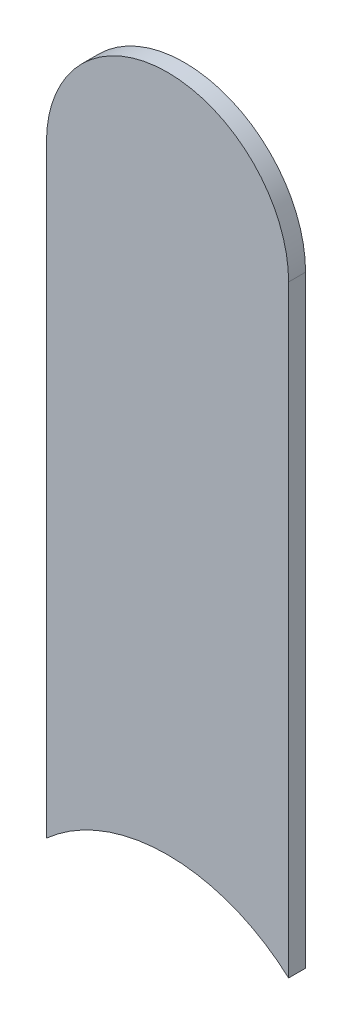
ISO-10303-21;
HEADER;
FILE_DESCRIPTION(('STEP AP214'),'2;1');
FILE_NAME('part.step','',(''),(''),'','','');
FILE_SCHEMA(('AUTOMOTIVE_DESIGN { 1 0 10303 214 1 1 1 1 }'));
ENDSEC;
DATA;
#1=APPLICATION_CONTEXT('core data for automotive mechanical design processes');
#2=APPLICATION_PROTOCOL_DEFINITION('international standard','automotive_design',2000,#1);
#3=PRODUCT_CONTEXT('',#1,'mechanical');
#4=PRODUCT('Part','Part','',(#3));
#5=PRODUCT_RELATED_PRODUCT_CATEGORY('part','',(#4));
#6=PRODUCT_DEFINITION_FORMATION('','',#4);
#7=PRODUCT_DEFINITION_CONTEXT('part definition',#1,'design');
#8=PRODUCT_DEFINITION('design','',#6,#7);
#9=PRODUCT_DEFINITION_SHAPE('','',#8);
#10=(LENGTH_UNIT() NAMED_UNIT(*) SI_UNIT(.MILLI.,.METRE.));
#11=(NAMED_UNIT(*) PLANE_ANGLE_UNIT() SI_UNIT($,.RADIAN.));
#12=(NAMED_UNIT(*) SI_UNIT($,.STERADIAN.) SOLID_ANGLE_UNIT());
#13=UNCERTAINTY_MEASURE_WITH_UNIT(LENGTH_MEASURE(1.E-05),#10,'distance_accuracy_value','');
#14=(GEOMETRIC_REPRESENTATION_CONTEXT(3) GLOBAL_UNCERTAINTY_ASSIGNED_CONTEXT((#13)) GLOBAL_UNIT_ASSIGNED_CONTEXT((#10,
#11,#12)) REPRESENTATION_CONTEXT('',''));
#15=CARTESIAN_POINT('',(0.,0.,0.));
#16=DIRECTION('',(0.,0.,1.));
#17=DIRECTION('',(1.,0.,0.));
#18=AXIS2_PLACEMENT_3D('',#15,#16,#17);
#19=CARTESIAN_POINT('',(150.11,-80.772,-0.035));
#20=DIRECTION('',(-1.,0.,0.));
#21=DIRECTION('',(0.,0.,1.));
#22=AXIS2_PLACEMENT_3D('',#19,#20,#21);
#23=PLANE('',#22);
#24=DIRECTION('',(0.,0.,1.));
#25=VECTOR('',#24,1.);
#26=CARTESIAN_POINT('',(150.11,-79.248,-0.035));
#27=LINE('',#26,#25);
#28=CARTESIAN_POINT('',(150.11,-79.248,-0.035));
#29=VERTEX_POINT('',#28);
#30=CARTESIAN_POINT('',(150.11,-79.248,0.));
#31=VERTEX_POINT('',#30);
#32=EDGE_CURVE('E11',#29,#31,#27,.T.);
#33=ORIENTED_EDGE('',*,*,#32,.T.);
#34=DIRECTION('',(0.,1.,0.));
#35=VECTOR('',#34,1.);
#36=CARTESIAN_POINT('',(150.11,-80.772,0.));
#37=LINE('',#36,#35);
#38=CARTESIAN_POINT('',(150.11,-80.49249150282,0.));
#39=VERTEX_POINT('',#38);
#40=EDGE_CURVE('E26',#39,#31,#37,.T.);
#41=ORIENTED_EDGE('',*,*,#40,.F.);
#42=DIRECTION('',(0.,0.,-1.));
#43=VECTOR('',#42,1.);
#44=CARTESIAN_POINT('',(150.11,-80.49249150281,-0.045));
#45=LINE('',#44,#43);
#46=CARTESIAN_POINT('',(150.11,-80.49249150282,-0.035));
#47=VERTEX_POINT('',#46);
#48=EDGE_CURVE('E71',#39,#47,#45,.T.);
#49=ORIENTED_EDGE('',*,*,#48,.T.);
#50=DIRECTION('',(0.,1.,0.));
#51=VECTOR('',#50,1.);
#52=CARTESIAN_POINT('',(150.11,-80.772,-0.035));
#53=LINE('',#52,#51);
#54=EDGE_CURVE('E62',#47,#29,#53,.T.);
#55=ORIENTED_EDGE('',*,*,#54,.T.);
#56=EDGE_LOOP('',(#33,#41,#49,#55));
#57=FACE_BOUND('',#56,.T.);
#58=ADVANCED_FACE('F17',(#57),#23,.F.);
#59=CARTESIAN_POINT('',(149.86,-79.248,-0.035));
#60=DIRECTION('',(0.,0.,-1.));
#61=DIRECTION('',(1.,0.,0.));
#62=AXIS2_PLACEMENT_3D('',#59,#60,#61);
#63=CYLINDRICAL_SURFACE('',#62,0.25);
#64=CARTESIAN_POINT('',(149.86,-79.248,-0.035));
#65=DIRECTION('',(0.,0.,1.));
#66=DIRECTION('',(1.,0.,0.));
#67=AXIS2_PLACEMENT_3D('',#64,#65,#66);
#68=CIRCLE('',#67,0.25);
#69=CARTESIAN_POINT('',(149.61,-79.248,-0.035));
#70=VERTEX_POINT('',#69);
#71=EDGE_CURVE('E54',#29,#70,#68,.T.);
#72=ORIENTED_EDGE('',*,*,#71,.T.);
#73=DIRECTION('',(0.,0.,1.));
#74=VECTOR('',#73,1.);
#75=CARTESIAN_POINT('',(149.61,-79.248,-0.035));
#76=LINE('',#75,#74);
#77=CARTESIAN_POINT('',(149.61,-79.248,0.));
#78=VERTEX_POINT('',#77);
#79=EDGE_CURVE('E81',#70,#78,#76,.T.);
#80=ORIENTED_EDGE('',*,*,#79,.T.);
#81=CARTESIAN_POINT('',(149.86,-79.248,0.));
#82=DIRECTION('',(0.,0.,1.));
#83=DIRECTION('',(1.,0.,0.));
#84=AXIS2_PLACEMENT_3D('',#81,#82,#83);
#85=CIRCLE('',#84,0.25);
#86=EDGE_CURVE('E57',#31,#78,#85,.T.);
#87=ORIENTED_EDGE('',*,*,#86,.F.);
#88=ORIENTED_EDGE('',*,*,#32,.F.);
#89=EDGE_LOOP('',(#72,#80,#87,#88));
#90=FACE_BOUND('',#89,.T.);
#91=ADVANCED_FACE('F52',(#90),#63,.T.);
#92=CARTESIAN_POINT('',(149.61,-79.248,0.));
#93=DIRECTION('',(0.,0.,1.));
#94=DIRECTION('',(1.,0.,0.));
#95=AXIS2_PLACEMENT_3D('',#92,#93,#94);
#96=PLANE('',#95);
#97=ORIENTED_EDGE('',*,*,#86,.T.);
#98=DIRECTION('',(0.,-1.,0.));
#99=VECTOR('',#98,1.);
#100=CARTESIAN_POINT('',(149.61,-79.248,0.));
#101=LINE('',#100,#99);
#102=CARTESIAN_POINT('',(149.61,-80.49249150281,0.));
#103=VERTEX_POINT('',#102);
#104=EDGE_CURVE('E109',#78,#103,#101,.T.);
#105=ORIENTED_EDGE('',*,*,#104,.T.);
#106=CARTESIAN_POINT('',(149.86,-80.772,0.));
#107=DIRECTION('',(0.,0.,-1.));
#108=DIRECTION('',(0.,-1.,0.));
#109=AXIS2_PLACEMENT_3D('',#106,#107,#108);
#110=CIRCLE('',#109,0.375);
#111=EDGE_CURVE('E67',#103,#39,#110,.T.);
#112=ORIENTED_EDGE('',*,*,#111,.T.);
#113=ORIENTED_EDGE('',*,*,#40,.T.);
#114=EDGE_LOOP('',(#97,#105,#112,#113));
#115=FACE_BOUND('',#114,.T.);
#116=ADVANCED_FACE('F91',(#115),#96,.T.);
#117=CARTESIAN_POINT('',(149.86,-80.772,-0.045));
#118=DIRECTION('',(0.,0.,-1.));
#119=DIRECTION('',(0.,-1.,0.));
#120=AXIS2_PLACEMENT_3D('',#117,#118,#119);
#121=CYLINDRICAL_SURFACE('',#120,0.375);
#122=ORIENTED_EDGE('',*,*,#111,.F.);
#123=DIRECTION('',(0.,0.,-1.));
#124=VECTOR('',#123,1.);
#125=CARTESIAN_POINT('',(149.61,-80.49249150281,-0.045));
#126=LINE('',#125,#124);
#127=CARTESIAN_POINT('',(149.61,-80.49249150281,-0.035));
#128=VERTEX_POINT('',#127);
#129=EDGE_CURVE('E106',#103,#128,#126,.T.);
#130=ORIENTED_EDGE('',*,*,#129,.T.);
#131=CARTESIAN_POINT('',(149.86,-80.772,-0.035));
#132=DIRECTION('',(0.,0.,-1.));
#133=DIRECTION('',(0.,-1.,0.));
#134=AXIS2_PLACEMENT_3D('',#131,#132,#133);
#135=CIRCLE('',#134,0.375);
#136=EDGE_CURVE('E68',#128,#47,#135,.T.);
#137=ORIENTED_EDGE('',*,*,#136,.T.);
#138=ORIENTED_EDGE('',*,*,#48,.F.);
#139=EDGE_LOOP('',(#122,#130,#137,#138));
#140=FACE_BOUND('',#139,.T.);
#141=ADVANCED_FACE('F96',(#140),#121,.F.);
#142=CARTESIAN_POINT('',(149.61,-79.248,-0.035));
#143=DIRECTION('',(0.,0.,1.));
#144=DIRECTION('',(1.,0.,0.));
#145=AXIS2_PLACEMENT_3D('',#142,#143,#144);
#146=PLANE('',#145);
#147=ORIENTED_EDGE('',*,*,#54,.F.);
#148=ORIENTED_EDGE('',*,*,#136,.F.);
#149=DIRECTION('',(0.,-1.,0.));
#150=VECTOR('',#149,1.);
#151=CARTESIAN_POINT('',(149.61,-79.248,-0.035));
#152=LINE('',#151,#150);
#153=EDGE_CURVE('E64',#70,#128,#152,.T.);
#154=ORIENTED_EDGE('',*,*,#153,.F.);
#155=ORIENTED_EDGE('',*,*,#71,.F.);
#156=EDGE_LOOP('',(#147,#148,#154,#155));
#157=FACE_BOUND('',#156,.T.);
#158=ADVANCED_FACE('F60',(#157),#146,.F.);
#159=CARTESIAN_POINT('',(149.61,-79.248,-0.035));
#160=DIRECTION('',(1.,0.,0.));
#161=DIRECTION('',(0.,1.,0.));
#162=AXIS2_PLACEMENT_3D('',#159,#160,#161);
#163=PLANE('',#162);
#164=ORIENTED_EDGE('',*,*,#129,.F.);
#165=ORIENTED_EDGE('',*,*,#104,.F.);
#166=ORIENTED_EDGE('',*,*,#79,.F.);
#167=ORIENTED_EDGE('',*,*,#153,.T.);
#168=EDGE_LOOP('',(#164,#165,#166,#167));
#169=FACE_BOUND('',#168,.T.);
#170=ADVANCED_FACE('F122',(#169),#163,.F.);
#171=CLOSED_SHELL('',(#58,#91,#116,#141,#158,#170));
#172=MANIFOLD_SOLID_BREP('B1',#171);
#173=ADVANCED_BREP_SHAPE_REPRESENTATION('',(#18,#172),#14);
#174=SHAPE_DEFINITION_REPRESENTATION(#9,#173);
ENDSEC;
END-ISO-10303-21;
